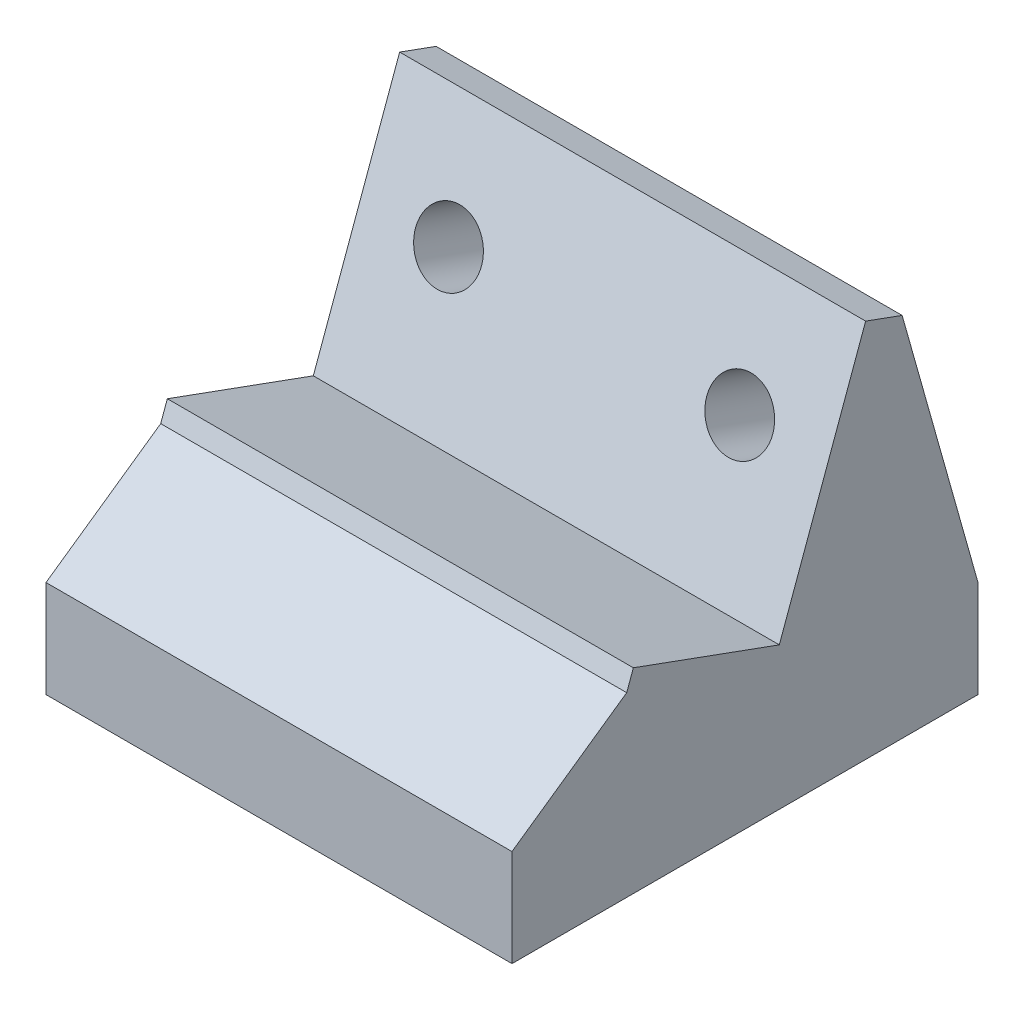
ISO-10303-21;
HEADER;
FILE_DESCRIPTION(('STEP AP214'),'2;1');
FILE_NAME('part.step','',(''),(''),'','','');
FILE_SCHEMA(('AUTOMOTIVE_DESIGN { 1 0 10303 214 1 1 1 1 }'));
ENDSEC;
DATA;
#1=APPLICATION_CONTEXT('core data for automotive mechanical design processes');
#2=APPLICATION_PROTOCOL_DEFINITION('international standard','automotive_design',2000,#1);
#3=PRODUCT_CONTEXT('',#1,'mechanical');
#4=PRODUCT('Part','Part','',(#3));
#5=PRODUCT_RELATED_PRODUCT_CATEGORY('part','',(#4));
#6=PRODUCT_DEFINITION_FORMATION('','',#4);
#7=PRODUCT_DEFINITION_CONTEXT('part definition',#1,'design');
#8=PRODUCT_DEFINITION('design','',#6,#7);
#9=PRODUCT_DEFINITION_SHAPE('','',#8);
#10=(LENGTH_UNIT() NAMED_UNIT(*) SI_UNIT(.MILLI.,.METRE.));
#11=(NAMED_UNIT(*) PLANE_ANGLE_UNIT() SI_UNIT($,.RADIAN.));
#12=(NAMED_UNIT(*) SI_UNIT($,.STERADIAN.) SOLID_ANGLE_UNIT());
#13=UNCERTAINTY_MEASURE_WITH_UNIT(LENGTH_MEASURE(1.E-05),#10,'distance_accuracy_value','');
#14=(GEOMETRIC_REPRESENTATION_CONTEXT(3) GLOBAL_UNCERTAINTY_ASSIGNED_CONTEXT((#13)) GLOBAL_UNIT_ASSIGNED_CONTEXT((#10,
#11,#12)) REPRESENTATION_CONTEXT('',''));
#15=CARTESIAN_POINT('',(0.,0.,0.));
#16=DIRECTION('',(0.,0.,1.));
#17=DIRECTION('',(1.,0.,0.));
#18=AXIS2_PLACEMENT_3D('',#15,#16,#17);
#19=CARTESIAN_POINT('',(-14.5715789473684,2.54,-11.3965789473684));
#20=DIRECTION('',(1.,0.,0.));
#21=DIRECTION('',(0.,0.,-1.));
#22=AXIS2_PLACEMENT_3D('',#19,#20,#21);
#23=PLANE('',#22);
#24=DIRECTION('',(0.,-1.,0.));
#25=VECTOR('',#24,1.);
#26=CARTESIAN_POINT('',(-14.5715789473684,2.54,-11.3965789473684));
#27=LINE('',#26,#25);
#28=CARTESIAN_POINT('',(-14.5715789473684,2.54000000000002,-11.3965789473684));
#29=VERTEX_POINT('',#28);
#30=CARTESIAN_POINT('',(-14.5715789473684,-3.81,-11.3965789473684));
#31=VERTEX_POINT('',#30);
#32=EDGE_CURVE('E121',#29,#31,#27,.T.);
#33=ORIENTED_EDGE('',*,*,#32,.T.);
#34=DIRECTION('',(0.,0.,-1.));
#35=VECTOR('',#34,1.);
#36=CARTESIAN_POINT('',(-14.5715789473684,-3.81,-11.3965789473684));
#37=LINE('',#36,#35);
#38=CARTESIAN_POINT('',(-14.5715789473684,-3.81,19.0834210526316));
#39=VERTEX_POINT('',#38);
#40=EDGE_CURVE('E370',#39,#31,#37,.T.);
#41=ORIENTED_EDGE('',*,*,#40,.F.);
#42=DIRECTION('',(0.,-1.,0.));
#43=VECTOR('',#42,1.);
#44=CARTESIAN_POINT('',(-14.5715789473684,2.54,19.0834210526316));
#45=LINE('',#44,#43);
#46=CARTESIAN_POINT('',(-14.5715789473684,2.54,19.0834210526316));
#47=VERTEX_POINT('',#46);
#48=EDGE_CURVE('E12',#47,#39,#45,.T.);
#49=ORIENTED_EDGE('',*,*,#48,.F.);
#50=DIRECTION('',(0.,-0.573190033254364,0.819422470876813));
#51=VECTOR('',#50,1.);
#52=CARTESIAN_POINT('',(-14.5715789473684,7.78796051133127,11.5810282687873));
#53=LINE('',#52,#51);
#54=CARTESIAN_POINT('',(-14.5715789473684,7.78796051133127,11.5810282687873));
#55=VERTEX_POINT('',#54);
#56=EDGE_CURVE('E174',#55,#47,#53,.T.);
#57=ORIENTED_EDGE('',*,*,#56,.F.);
#58=DIRECTION('',(0.,-0.939692620785909,0.342020143325668));
#59=VECTOR('',#58,1.);
#60=CARTESIAN_POINT('',(-14.5715789473684,8.98137013972938,11.1466626867637));
#61=LINE('',#60,#59);
#62=CARTESIAN_POINT('',(-14.5715789473684,8.98137013972938,11.1466626867637));
#63=VERTEX_POINT('',#62);
#64=EDGE_CURVE('E146',#63,#55,#61,.T.);
#65=ORIENTED_EDGE('',*,*,#64,.F.);
#66=DIRECTION('',(0.,0.342020143325668,0.939692620785909));
#67=VECTOR('',#66,1.);
#68=CARTESIAN_POINT('',(-14.5715789473684,4.6377143194934,-0.787433597217365));
#69=LINE('',#68,#67);
#70=CARTESIAN_POINT('',(-14.5715789473684,5.50644548354059,1.59938565957884));
#71=VERTEX_POINT('',#70);
#72=EDGE_CURVE('E159',#71,#63,#69,.T.);
#73=ORIENTED_EDGE('',*,*,#72,.F.);
#74=DIRECTION('',(0.,-0.939692620785909,0.342020143325668));
#75=VECTOR('',#74,1.);
#76=CARTESIAN_POINT('',(-14.5715789473684,21.0207706527159,-4.04736690672793));
#77=LINE('',#76,#75);
#78=CARTESIAN_POINT('',(-14.5715789473684,21.0207706527159,-4.04736690672793));
#79=VERTEX_POINT('',#78);
#80=EDGE_CURVE('E163',#79,#71,#77,.T.);
#81=ORIENTED_EDGE('',*,*,#80,.F.);
#82=DIRECTION('',(0.,-0.342020143325668,-0.939692620785909));
#83=VECTOR('',#82,1.);
#84=CARTESIAN_POINT('',(-14.5715789473684,21.0207706527159,-4.04736690672793));
#85=LINE('',#84,#83);
#86=CARTESIAN_POINT('',(-14.5715789473684,20.1520394886687,-6.43418616352414));
#87=VERTEX_POINT('',#86);
#88=EDGE_CURVE('E144',#79,#87,#85,.T.);
#89=ORIENTED_EDGE('',*,*,#88,.T.);
#90=DIRECTION('',(0.,-0.96252254111335,-0.27120169219365));
#91=VECTOR('',#90,1.);
#92=CARTESIAN_POINT('',(-14.5715789473684,11.3460197443344,-8.91538255544628));
#93=LINE('',#92,#91);
#94=EDGE_CURVE('E137',#87,#29,#93,.T.);
#95=ORIENTED_EDGE('',*,*,#94,.T.);
#96=EDGE_LOOP('',(#33,#41,#49,#57,#65,#73,#81,#89,#95));
#97=FACE_BOUND('',#96,.T.);
#98=ADVANCED_FACE('F48',(#97),#23,.F.);
#99=CARTESIAN_POINT('',(-14.5715789473684,2.54,19.0834210526316));
#100=DIRECTION('',(0.,0.,-1.));
#101=DIRECTION('',(-1.,0.,0.));
#102=AXIS2_PLACEMENT_3D('',#99,#100,#101);
#103=PLANE('',#102);
#104=ORIENTED_EDGE('',*,*,#48,.T.);
#105=DIRECTION('',(-1.,0.,0.));
#106=VECTOR('',#105,1.);
#107=CARTESIAN_POINT('',(-14.5715789473684,-3.81,19.0834210526316));
#108=LINE('',#107,#106);
#109=CARTESIAN_POINT('',(15.9084210526316,-3.81,19.0834210526316));
#110=VERTEX_POINT('',#109);
#111=EDGE_CURVE('E363',#110,#39,#108,.T.);
#112=ORIENTED_EDGE('',*,*,#111,.F.);
#113=DIRECTION('',(0.,-1.,0.));
#114=VECTOR('',#113,1.);
#115=CARTESIAN_POINT('',(15.9084210526316,2.54,19.0834210526316));
#116=LINE('',#115,#114);
#117=CARTESIAN_POINT('',(15.9084210526316,2.54,19.0834210526316));
#118=VERTEX_POINT('',#117);
#119=EDGE_CURVE('E57',#118,#110,#116,.T.);
#120=ORIENTED_EDGE('',*,*,#119,.F.);
#121=DIRECTION('',(1.,0.,0.));
#122=VECTOR('',#121,1.);
#123=CARTESIAN_POINT('',(0.,2.54,19.0834210526316));
#124=LINE('',#123,#122);
#125=EDGE_CURVE('E140',#47,#118,#124,.T.);
#126=ORIENTED_EDGE('',*,*,#125,.F.);
#127=EDGE_LOOP('',(#104,#112,#120,#126));
#128=FACE_BOUND('',#127,.T.);
#129=ADVANCED_FACE('F205',(#128),#103,.F.);
#130=CARTESIAN_POINT('',(15.9084210526316,2.54,-11.3965789473684));
#131=DIRECTION('',(-1.,0.,0.));
#132=DIRECTION('',(0.,0.,1.));
#133=AXIS2_PLACEMENT_3D('',#130,#131,#132);
#134=PLANE('',#133);
#135=DIRECTION('',(0.,-0.96252254111335,-0.27120169219365));
#136=VECTOR('',#135,1.);
#137=CARTESIAN_POINT('',(15.9084210526316,20.1520394886687,-6.43418616352414));
#138=LINE('',#137,#136);
#139=CARTESIAN_POINT('',(15.9084210526316,20.1520394886687,-6.43418616352414));
#140=VERTEX_POINT('',#139);
#141=CARTESIAN_POINT('',(15.9084210526316,2.54,-11.3965789473684));
#142=VERTEX_POINT('',#141);
#143=EDGE_CURVE('E139',#140,#142,#138,.T.);
#144=ORIENTED_EDGE('',*,*,#143,.F.);
#145=DIRECTION('',(0.,-0.342020143325668,-0.939692620785909));
#146=VECTOR('',#145,1.);
#147=CARTESIAN_POINT('',(15.9084210526316,21.0207706527159,-4.04736690672793));
#148=LINE('',#147,#146);
#149=CARTESIAN_POINT('',(15.9084210526316,21.0207706527159,-4.04736690672793));
#150=VERTEX_POINT('',#149);
#151=EDGE_CURVE('E352',#150,#140,#148,.T.);
#152=ORIENTED_EDGE('',*,*,#151,.F.);
#153=DIRECTION('',(0.,0.939692620785909,-0.342020143325668));
#154=VECTOR('',#153,1.);
#155=CARTESIAN_POINT('',(15.9084210526316,21.0207706527159,-4.04736690672793));
#156=LINE('',#155,#154);
#157=CARTESIAN_POINT('',(15.9084210526316,5.50644548354059,1.59938565957884));
#158=VERTEX_POINT('',#157);
#159=EDGE_CURVE('E168',#158,#150,#156,.T.);
#160=ORIENTED_EDGE('',*,*,#159,.F.);
#161=DIRECTION('',(0.,0.342020143325668,0.939692620785909));
#162=VECTOR('',#161,1.);
#163=CARTESIAN_POINT('',(15.9084210526316,4.6377143194934,-0.787433597217365));
#164=LINE('',#163,#162);
#165=CARTESIAN_POINT('',(15.9084210526316,8.98137013972938,11.1466626867637));
#166=VERTEX_POINT('',#165);
#167=EDGE_CURVE('E157',#158,#166,#164,.T.);
#168=ORIENTED_EDGE('',*,*,#167,.T.);
#169=DIRECTION('',(0.,0.939692620785909,-0.342020143325668));
#170=VECTOR('',#169,1.);
#171=CARTESIAN_POINT('',(15.9084210526316,8.98137013972938,11.1466626867637));
#172=LINE('',#171,#170);
#173=CARTESIAN_POINT('',(15.9084210526316,7.78796051133127,11.5810282687873));
#174=VERTEX_POINT('',#173);
#175=EDGE_CURVE('E158',#174,#166,#172,.T.);
#176=ORIENTED_EDGE('',*,*,#175,.F.);
#177=DIRECTION('',(0.,-0.573190033254364,0.819422470876813));
#178=VECTOR('',#177,1.);
#179=CARTESIAN_POINT('',(15.9084210526316,7.78796051133127,11.5810282687873));
#180=LINE('',#179,#178);
#181=EDGE_CURVE('E171',#174,#118,#180,.T.);
#182=ORIENTED_EDGE('',*,*,#181,.T.);
#183=ORIENTED_EDGE('',*,*,#119,.T.);
#184=DIRECTION('',(0.,0.,1.));
#185=VECTOR('',#184,1.);
#186=CARTESIAN_POINT('',(15.9084210526316,-3.81,-11.3965789473684));
#187=LINE('',#186,#185);
#188=CARTESIAN_POINT('',(15.9084210526316,-3.81,-11.3965789473684));
#189=VERTEX_POINT('',#188);
#190=EDGE_CURVE('E366',#189,#110,#187,.T.);
#191=ORIENTED_EDGE('',*,*,#190,.F.);
#192=DIRECTION('',(0.,-1.,0.));
#193=VECTOR('',#192,1.);
#194=CARTESIAN_POINT('',(15.9084210526316,2.54,-11.3965789473684));
#195=LINE('',#194,#193);
#196=EDGE_CURVE('E130',#142,#189,#195,.T.);
#197=ORIENTED_EDGE('',*,*,#196,.F.);
#198=EDGE_LOOP('',(#144,#152,#160,#168,#176,#182,#183,#191,#197));
#199=FACE_BOUND('',#198,.T.);
#200=ADVANCED_FACE('F203',(#199),#134,.F.);
#201=CARTESIAN_POINT('',(-14.5715789473684,2.54,-11.3965789473684));
#202=DIRECTION('',(0.,0.,1.));
#203=DIRECTION('',(1.,0.,0.));
#204=AXIS2_PLACEMENT_3D('',#201,#202,#203);
#205=PLANE('',#204);
#206=ORIENTED_EDGE('',*,*,#196,.T.);
#207=DIRECTION('',(1.,0.,0.));
#208=VECTOR('',#207,1.);
#209=CARTESIAN_POINT('',(-14.5715789473684,-3.81,-11.3965789473684));
#210=LINE('',#209,#208);
#211=EDGE_CURVE('E125',#31,#189,#210,.T.);
#212=ORIENTED_EDGE('',*,*,#211,.F.);
#213=ORIENTED_EDGE('',*,*,#32,.F.);
#214=DIRECTION('',(1.,0.,0.));
#215=VECTOR('',#214,1.);
#216=CARTESIAN_POINT('',(0.,2.54,-11.3965789473684));
#217=LINE('',#216,#215);
#218=EDGE_CURVE('E85',#142,#29,#217,.F.);
#219=ORIENTED_EDGE('',*,*,#218,.F.);
#220=EDGE_LOOP('',(#206,#212,#213,#219));
#221=FACE_BOUND('',#220,.T.);
#222=ADVANCED_FACE('F122',(#221),#205,.F.);
#223=CARTESIAN_POINT('',(0.,10.6686837650343,7.46279656636318));
#224=DIRECTION('',(0.,0.819422470876813,0.573190033254364));
#225=DIRECTION('',(0.,-0.573190033254364,0.819422470876813));
#226=AXIS2_PLACEMENT_3D('',#223,#224,#225);
#227=PLANE('',#226);
#228=ORIENTED_EDGE('',*,*,#56,.T.);
#229=ORIENTED_EDGE('',*,*,#125,.T.);
#230=ORIENTED_EDGE('',*,*,#181,.F.);
#231=DIRECTION('',(1.,0.,0.));
#232=VECTOR('',#231,1.);
#233=CARTESIAN_POINT('',(-14.5715789473684,7.78796051133127,11.5810282687873));
#234=LINE('',#233,#232);
#235=EDGE_CURVE('E182',#55,#174,#234,.T.);
#236=ORIENTED_EDGE('',*,*,#235,.F.);
#237=EDGE_LOOP('',(#228,#229,#230,#236));
#238=FACE_BOUND('',#237,.T.);
#239=ADVANCED_FACE('F189',(#238),#227,.T.);
#240=CARTESIAN_POINT('',(-14.5715789473684,21.0207706527159,-4.04736690672793));
#241=DIRECTION('',(0.,-0.939692620785909,0.342020143325668));
#242=DIRECTION('',(1.,0.,0.));
#243=AXIS2_PLACEMENT_3D('',#240,#241,#242);
#244=PLANE('',#243);
#245=DIRECTION('',(1.,0.,0.));
#246=VECTOR('',#245,1.);
#247=CARTESIAN_POINT('',(-14.5715789473684,20.1520394886687,-6.43418616352414));
#248=LINE('',#247,#246);
#249=EDGE_CURVE('E161',#140,#87,#248,.F.);
#250=ORIENTED_EDGE('',*,*,#249,.T.);
#251=ORIENTED_EDGE('',*,*,#88,.F.);
#252=DIRECTION('',(-1.,0.,0.));
#253=VECTOR('',#252,1.);
#254=CARTESIAN_POINT('',(-14.5715789473684,21.0207706527159,-4.04736690672793));
#255=LINE('',#254,#253);
#256=EDGE_CURVE('E117',#150,#79,#255,.T.);
#257=ORIENTED_EDGE('',*,*,#256,.F.);
#258=ORIENTED_EDGE('',*,*,#151,.T.);
#259=EDGE_LOOP('',(#250,#251,#257,#258));
#260=FACE_BOUND('',#259,.T.);
#261=ADVANCED_FACE('F199',(#260),#244,.F.);
#262=CARTESIAN_POINT('',(0.,15.0851280272622,-1.88696966982109));
#263=DIRECTION('',(0.,0.342020143325668,0.939692620785909));
#264=DIRECTION('',(0.,-0.939692620785909,0.342020143325668));
#265=AXIS2_PLACEMENT_3D('',#262,#263,#264);
#266=PLANE('',#265);
#267=CARTESIAN_POINT('',(-8.85657894736841,14.0989948080069,-1.52804653099106));
#268=DIRECTION('',(0.,0.342020143325668,0.939692620785909));
#269=DIRECTION('',(0.,-0.939692620785909,0.342020143325668));
#270=AXIS2_PLACEMENT_3D('',#267,#268,#269);
#271=CIRCLE('',#270,2.159);
#272=CARTESIAN_POINT('',(-8.85657894736841,12.0701984397302,-0.789625041550943));
#273=VERTEX_POINT('',#272);
#274=EDGE_CURVE('E357',#273,#273,#271,.T.);
#275=ORIENTED_EDGE('',*,*,#274,.F.);
#276=EDGE_LOOP('',(#275));
#277=FACE_BOUND('',#276,.T.);
#278=CARTESIAN_POINT('',(10.1934210526316,14.0989948080069,-1.52804653099106));
#279=DIRECTION('',(0.,0.342020143325668,0.939692620785909));
#280=DIRECTION('',(0.,-0.939692620785909,0.342020143325668));
#281=AXIS2_PLACEMENT_3D('',#278,#279,#280);
#282=CIRCLE('',#281,2.159);
#283=CARTESIAN_POINT('',(10.1934210526316,12.0701984397302,-0.789625041550943));
#284=VERTEX_POINT('',#283);
#285=EDGE_CURVE('E151',#284,#284,#282,.T.);
#286=ORIENTED_EDGE('',*,*,#285,.F.);
#287=EDGE_LOOP('',(#286));
#288=FACE_BOUND('',#287,.T.);
#289=ORIENTED_EDGE('',*,*,#80,.T.);
#290=DIRECTION('',(1.,0.,0.));
#291=VECTOR('',#290,1.);
#292=CARTESIAN_POINT('',(-14.5715789473684,5.50644548354059,1.59938565957884));
#293=LINE('',#292,#291);
#294=EDGE_CURVE('E165',#71,#158,#293,.T.);
#295=ORIENTED_EDGE('',*,*,#294,.T.);
#296=ORIENTED_EDGE('',*,*,#159,.T.);
#297=ORIENTED_EDGE('',*,*,#256,.T.);
#298=EDGE_LOOP('',(#289,#295,#296,#297));
#299=FACE_BOUND('',#298,.T.);
#300=ADVANCED_FACE('F285',(#277,#288,#299),#266,.T.);
#301=CARTESIAN_POINT('',(-14.5715789473684,4.6377143194934,-0.787433597217365));
#302=DIRECTION('',(0.,0.939692620785909,-0.342020143325668));
#303=DIRECTION('',(-1.,0.,0.));
#304=AXIS2_PLACEMENT_3D('',#301,#302,#303);
#305=PLANE('',#304);
#306=ORIENTED_EDGE('',*,*,#294,.F.);
#307=ORIENTED_EDGE('',*,*,#72,.T.);
#308=DIRECTION('',(-1.,0.,0.));
#309=VECTOR('',#308,1.);
#310=CARTESIAN_POINT('',(-14.5715789473684,8.98137013972938,11.1466626867637));
#311=LINE('',#310,#309);
#312=EDGE_CURVE('E154',#166,#63,#311,.T.);
#313=ORIENTED_EDGE('',*,*,#312,.F.);
#314=ORIENTED_EDGE('',*,*,#167,.F.);
#315=EDGE_LOOP('',(#306,#307,#313,#314));
#316=FACE_BOUND('',#315,.T.);
#317=ADVANCED_FACE('F276',(#316),#305,.T.);
#318=CARTESIAN_POINT('',(0.,18.560052683451,7.66030735736375));
#319=DIRECTION('',(0.,0.342020143325668,0.939692620785909));
#320=DIRECTION('',(0.,-0.939692620785909,0.342020143325668));
#321=AXIS2_PLACEMENT_3D('',#318,#319,#320);
#322=PLANE('',#321);
#323=ORIENTED_EDGE('',*,*,#64,.T.);
#324=ORIENTED_EDGE('',*,*,#235,.T.);
#325=ORIENTED_EDGE('',*,*,#175,.T.);
#326=ORIENTED_EDGE('',*,*,#312,.T.);
#327=EDGE_LOOP('',(#323,#324,#325,#326));
#328=FACE_BOUND('',#327,.T.);
#329=ADVANCED_FACE('F267',(#328),#322,.T.);
#330=CARTESIAN_POINT('',(0.,3.16175514302074,-11.2213923520267));
#331=DIRECTION('',(0.,0.27120169219365,-0.96252254111335));
#332=DIRECTION('',(0.,0.96252254111335,0.27120169219365));
#333=AXIS2_PLACEMENT_3D('',#330,#331,#332);
#334=PLANE('',#333);
#335=CARTESIAN_POINT('',(-8.85657894736841,11.4175611535763,-8.89522494830507));
#336=DIRECTION('',(0.,0.27120169219365,-0.96252254111335));
#337=DIRECTION('',(0.,0.96252254111335,0.27120169219365));
#338=AXIS2_PLACEMENT_3D('',#335,#336,#337);
#339=ELLIPSE('',#338,2.659787807094,2.159);
#340=CARTESIAN_POINT('',(-8.85657894736841,13.9776668724827,-8.17388599414514));
#341=VERTEX_POINT('',#340);
#342=EDGE_CURVE('E51',#341,#341,#339,.T.);
#343=ORIENTED_EDGE('',*,*,#342,.F.);
#344=EDGE_LOOP('',(#343));
#345=FACE_BOUND('',#344,.T.);
#346=CARTESIAN_POINT('',(10.1934210526316,11.4175611535763,-8.89522494830507));
#347=DIRECTION('',(0.,0.27120169219365,-0.96252254111335));
#348=DIRECTION('',(0.,0.96252254111335,0.27120169219365));
#349=AXIS2_PLACEMENT_3D('',#346,#347,#348);
#350=ELLIPSE('',#349,2.659787807094,2.159);
#351=CARTESIAN_POINT('',(10.1934210526316,13.9776668724827,-8.17388599414514));
#352=VERTEX_POINT('',#351);
#353=EDGE_CURVE('E149',#352,#352,#350,.T.);
#354=ORIENTED_EDGE('',*,*,#353,.F.);
#355=EDGE_LOOP('',(#354));
#356=FACE_BOUND('',#355,.T.);
#357=ORIENTED_EDGE('',*,*,#143,.T.);
#358=ORIENTED_EDGE('',*,*,#218,.T.);
#359=ORIENTED_EDGE('',*,*,#94,.F.);
#360=ORIENTED_EDGE('',*,*,#249,.F.);
#361=EDGE_LOOP('',(#357,#358,#359,#360));
#362=FACE_BOUND('',#361,.T.);
#363=ADVANCED_FACE('F135',(#345,#356,#362),#334,.T.);
#364=CARTESIAN_POINT('',(10.1934210526316,9.27804053560334,-14.7735095346433));
#365=DIRECTION('',(0.,0.342020143325668,0.939692620785909));
#366=DIRECTION('',(0.,-0.939692620785909,0.342020143325668));
#367=AXIS2_PLACEMENT_3D('',#364,#365,#366);
#368=CYLINDRICAL_SURFACE('',#367,2.159);
#369=ORIENTED_EDGE('',*,*,#353,.T.);
#370=EDGE_LOOP('',(#369));
#371=FACE_BOUND('',#370,.T.);
#372=ORIENTED_EDGE('',*,*,#285,.T.);
#373=EDGE_LOOP('',(#372));
#374=FACE_BOUND('',#373,.T.);
#375=ADVANCED_FACE('F255',(#371,#374),#368,.F.);
#376=CARTESIAN_POINT('',(-8.85657894736841,9.27804053560334,-14.7735095346433));
#377=DIRECTION('',(0.,0.342020143325668,0.939692620785909));
#378=DIRECTION('',(0.,-0.939692620785909,0.342020143325668));
#379=AXIS2_PLACEMENT_3D('',#376,#377,#378);
#380=CYLINDRICAL_SURFACE('',#379,2.159);
#381=ORIENTED_EDGE('',*,*,#342,.T.);
#382=EDGE_LOOP('',(#381));
#383=FACE_BOUND('',#382,.T.);
#384=ORIENTED_EDGE('',*,*,#274,.T.);
#385=EDGE_LOOP('',(#384));
#386=FACE_BOUND('',#385,.T.);
#387=ADVANCED_FACE('F221',(#383,#386),#380,.F.);
#388=CARTESIAN_POINT('',(0.,-3.81,0.));
#389=DIRECTION('',(0.,1.,0.));
#390=DIRECTION('',(0.,0.,1.));
#391=AXIS2_PLACEMENT_3D('',#388,#389,#390);
#392=PLANE('',#391);
#393=ORIENTED_EDGE('',*,*,#40,.T.);
#394=ORIENTED_EDGE('',*,*,#211,.T.);
#395=ORIENTED_EDGE('',*,*,#190,.T.);
#396=ORIENTED_EDGE('',*,*,#111,.T.);
#397=EDGE_LOOP('',(#393,#394,#395,#396));
#398=FACE_BOUND('',#397,.T.);
#399=ADVANCED_FACE('F245',(#398),#392,.F.);
#400=CLOSED_SHELL('',(#98,#129,#200,#222,#239,#261,#300,#317,#329,#363,#375,#387,#399));
#401=MANIFOLD_SOLID_BREP('B2',#400);
#402=ADVANCED_BREP_SHAPE_REPRESENTATION('',(#18,#401),#14);
#403=SHAPE_DEFINITION_REPRESENTATION(#9,#402);
ENDSEC;
END-ISO-10303-21;
